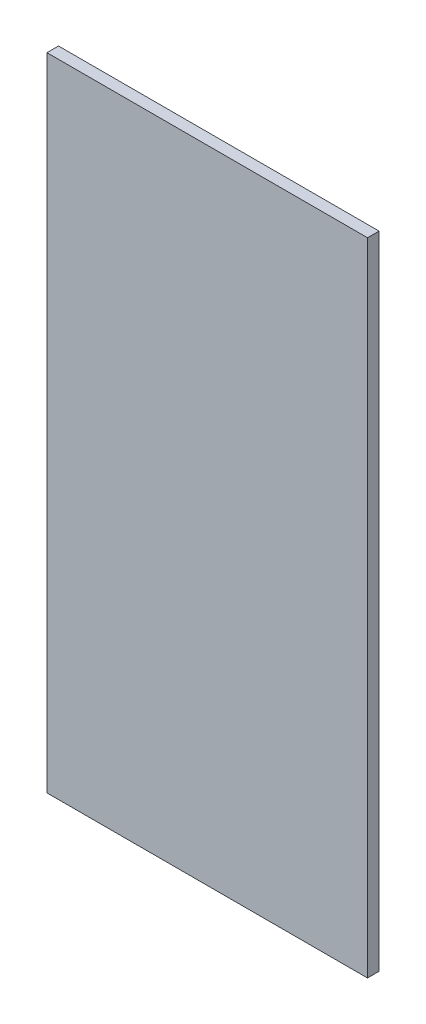
ISO-10303-21;
HEADER;
FILE_DESCRIPTION(('STEP AP214'),'2;1');
FILE_NAME('part.step','',(''),(''),'','','');
FILE_SCHEMA(('AUTOMOTIVE_DESIGN { 1 0 10303 214 1 1 1 1 }'));
ENDSEC;
DATA;
#1=APPLICATION_CONTEXT('core data for automotive mechanical design processes');
#2=APPLICATION_PROTOCOL_DEFINITION('international standard','automotive_design',2000,#1);
#3=PRODUCT_CONTEXT('',#1,'mechanical');
#4=PRODUCT('Part','Part','',(#3));
#5=PRODUCT_RELATED_PRODUCT_CATEGORY('part','',(#4));
#6=PRODUCT_DEFINITION_FORMATION('','',#4);
#7=PRODUCT_DEFINITION_CONTEXT('part definition',#1,'design');
#8=PRODUCT_DEFINITION('design','',#6,#7);
#9=PRODUCT_DEFINITION_SHAPE('','',#8);
#10=(LENGTH_UNIT() NAMED_UNIT(*) SI_UNIT(.MILLI.,.METRE.));
#11=(NAMED_UNIT(*) PLANE_ANGLE_UNIT() SI_UNIT($,.RADIAN.));
#12=(NAMED_UNIT(*) SI_UNIT($,.STERADIAN.) SOLID_ANGLE_UNIT());
#13=UNCERTAINTY_MEASURE_WITH_UNIT(LENGTH_MEASURE(1.E-05),#10,'distance_accuracy_value','');
#14=(GEOMETRIC_REPRESENTATION_CONTEXT(3) GLOBAL_UNCERTAINTY_ASSIGNED_CONTEXT((#13)) GLOBAL_UNIT_ASSIGNED_CONTEXT((#10,
#11,#12)) REPRESENTATION_CONTEXT('',''));
#15=CARTESIAN_POINT('',(0.,0.,0.));
#16=DIRECTION('',(0.,0.,1.));
#17=DIRECTION('',(1.,0.,0.));
#18=AXIS2_PLACEMENT_3D('',#15,#16,#17);
#19=CARTESIAN_POINT('',(0.375,0.5,-0.018));
#20=DIRECTION('',(0.,-1.,0.));
#21=DIRECTION('',(0.,0.,-1.));
#22=AXIS2_PLACEMENT_3D('',#19,#20,#21);
#23=PLANE('',#22);
#24=CARTESIAN_POINT('',(0.375,0.5,-0.018));
#25=CARTESIAN_POINT('',(0.875,0.5,-0.018));
#26=B_SPLINE_CURVE_WITH_KNOTS('',1,(#24,#25),.UNSPECIFIED.,.F.,.F.,(2,2),(-3.,-2.5),.UNSPECIFIED.);
#27=CARTESIAN_POINT('',(0.375,0.5,-0.018));
#28=VERTEX_POINT('',#27);
#29=CARTESIAN_POINT('',(0.875,0.5,-0.018));
#30=VERTEX_POINT('',#29);
#31=EDGE_CURVE('E11',#28,#30,#26,.T.);
#32=ORIENTED_EDGE('',*,*,#31,.T.);
#33=CARTESIAN_POINT('',(0.875,0.5,-0.018));
#34=CARTESIAN_POINT('',(0.875,0.5,0.));
#35=B_SPLINE_CURVE_WITH_KNOTS('',1,(#33,#34),.UNSPECIFIED.,.F.,.F.,(2,2),(0.,0.018),.UNSPECIFIED.);
#36=CARTESIAN_POINT('',(0.875,0.5,0.));
#37=VERTEX_POINT('',#36);
#38=EDGE_CURVE('E26',#30,#37,#35,.T.);
#39=ORIENTED_EDGE('',*,*,#38,.T.);
#40=CARTESIAN_POINT('',(0.375,0.5,0.));
#41=CARTESIAN_POINT('',(0.875,0.5,0.));
#42=B_SPLINE_CURVE_WITH_KNOTS('',1,(#40,#41),.UNSPECIFIED.,.F.,.F.,(2,2),(-3.,-2.5),.UNSPECIFIED.);
#43=CARTESIAN_POINT('',(0.375,0.5,0.));
#44=VERTEX_POINT('',#43);
#45=EDGE_CURVE('E132',#44,#37,#42,.T.);
#46=ORIENTED_EDGE('',*,*,#45,.F.);
#47=CARTESIAN_POINT('',(0.375,0.5,-0.018));
#48=CARTESIAN_POINT('',(0.375,0.5,0.));
#49=B_SPLINE_CURVE_WITH_KNOTS('',1,(#47,#48),.UNSPECIFIED.,.F.,.F.,(2,2),(0.,0.018),.UNSPECIFIED.);
#50=EDGE_CURVE('E79',#28,#44,#49,.T.);
#51=ORIENTED_EDGE('',*,*,#50,.F.);
#52=EDGE_LOOP('',(#32,#39,#46,#51));
#53=FACE_BOUND('',#52,.T.);
#54=ADVANCED_FACE('F17',(#53),#23,.T.);
#55=CARTESIAN_POINT('',(0.875,0.5,-0.018));
#56=DIRECTION('',(1.,0.,0.));
#57=DIRECTION('',(0.,0.,1.));
#58=AXIS2_PLACEMENT_3D('',#55,#56,#57);
#59=PLANE('',#58);
#60=CARTESIAN_POINT('',(0.875,0.5,-0.018));
#61=CARTESIAN_POINT('',(0.875,1.5,-0.018));
#62=B_SPLINE_CURVE_WITH_KNOTS('',1,(#60,#61),.UNSPECIFIED.,.F.,.F.,(2,2),(-2.5,-1.5),.UNSPECIFIED.);
#63=CARTESIAN_POINT('',(0.875,1.5,-0.018));
#64=VERTEX_POINT('',#63);
#65=EDGE_CURVE('E119',#30,#64,#62,.T.);
#66=ORIENTED_EDGE('',*,*,#65,.T.);
#67=CARTESIAN_POINT('',(0.875,1.5,-0.018));
#68=CARTESIAN_POINT('',(0.875,1.5,0.));
#69=B_SPLINE_CURVE_WITH_KNOTS('',1,(#67,#68),.UNSPECIFIED.,.F.,.F.,(2,2),(0.,0.018),.UNSPECIFIED.);
#70=CARTESIAN_POINT('',(0.875,1.5,0.));
#71=VERTEX_POINT('',#70);
#72=EDGE_CURVE('E112',#64,#71,#69,.T.);
#73=ORIENTED_EDGE('',*,*,#72,.T.);
#74=CARTESIAN_POINT('',(0.875,0.5,0.));
#75=CARTESIAN_POINT('',(0.875,1.5,0.));
#76=B_SPLINE_CURVE_WITH_KNOTS('',1,(#74,#75),.UNSPECIFIED.,.F.,.F.,(2,2),(-2.5,-1.5),.UNSPECIFIED.);
#77=EDGE_CURVE('E74',#37,#71,#76,.T.);
#78=ORIENTED_EDGE('',*,*,#77,.F.);
#79=ORIENTED_EDGE('',*,*,#38,.F.);
#80=EDGE_LOOP('',(#66,#73,#78,#79));
#81=FACE_BOUND('',#80,.T.);
#82=ADVANCED_FACE('F147',(#81),#59,.T.);
#83=CARTESIAN_POINT('',(0.875,1.5,-0.018));
#84=DIRECTION('',(0.,1.,0.));
#85=DIRECTION('',(0.,0.,1.));
#86=AXIS2_PLACEMENT_3D('',#83,#84,#85);
#87=PLANE('',#86);
#88=CARTESIAN_POINT('',(0.875,1.5,-0.018));
#89=CARTESIAN_POINT('',(0.375,1.5,-0.018));
#90=B_SPLINE_CURVE_WITH_KNOTS('',1,(#88,#89),.UNSPECIFIED.,.F.,.F.,(2,2),(-1.5,-1.),.UNSPECIFIED.);
#91=CARTESIAN_POINT('',(0.375,1.5,-0.018));
#92=VERTEX_POINT('',#91);
#93=EDGE_CURVE('E62',#64,#92,#90,.T.);
#94=ORIENTED_EDGE('',*,*,#93,.T.);
#95=CARTESIAN_POINT('',(0.375,1.5,-0.018));
#96=CARTESIAN_POINT('',(0.375,1.5,0.));
#97=B_SPLINE_CURVE_WITH_KNOTS('',1,(#95,#96),.UNSPECIFIED.,.F.,.F.,(2,2),(0.,0.018),.UNSPECIFIED.);
#98=CARTESIAN_POINT('',(0.375,1.5,0.));
#99=VERTEX_POINT('',#98);
#100=EDGE_CURVE('E56',#92,#99,#97,.T.);
#101=ORIENTED_EDGE('',*,*,#100,.T.);
#102=CARTESIAN_POINT('',(0.875,1.5,0.));
#103=CARTESIAN_POINT('',(0.375,1.5,0.));
#104=B_SPLINE_CURVE_WITH_KNOTS('',1,(#102,#103),.UNSPECIFIED.,.F.,.F.,(2,2),(-1.5,-1.),.UNSPECIFIED.);
#105=EDGE_CURVE('E60',#71,#99,#104,.T.);
#106=ORIENTED_EDGE('',*,*,#105,.F.);
#107=ORIENTED_EDGE('',*,*,#72,.F.);
#108=EDGE_LOOP('',(#94,#101,#106,#107));
#109=FACE_BOUND('',#108,.T.);
#110=ADVANCED_FACE('F58',(#109),#87,.T.);
#111=CARTESIAN_POINT('',(0.375,1.5,-0.018));
#112=DIRECTION('',(-1.,0.,0.));
#113=DIRECTION('',(0.,0.,-1.));
#114=AXIS2_PLACEMENT_3D('',#111,#112,#113);
#115=PLANE('',#114);
#116=CARTESIAN_POINT('',(0.375,1.5,-0.018));
#117=CARTESIAN_POINT('',(0.375,0.5,-0.018));
#118=B_SPLINE_CURVE_WITH_KNOTS('',1,(#116,#117),.UNSPECIFIED.,.F.,.F.,(2,2),(-1.,0.),.UNSPECIFIED.);
#119=EDGE_CURVE('E75',#92,#28,#118,.T.);
#120=ORIENTED_EDGE('',*,*,#119,.T.);
#121=ORIENTED_EDGE('',*,*,#50,.T.);
#122=CARTESIAN_POINT('',(0.375,1.5,0.));
#123=CARTESIAN_POINT('',(0.375,0.5,0.));
#124=B_SPLINE_CURVE_WITH_KNOTS('',1,(#122,#123),.UNSPECIFIED.,.F.,.F.,(2,2),(-1.,0.),.UNSPECIFIED.);
#125=EDGE_CURVE('E72',#99,#44,#124,.T.);
#126=ORIENTED_EDGE('',*,*,#125,.F.);
#127=ORIENTED_EDGE('',*,*,#100,.F.);
#128=EDGE_LOOP('',(#120,#121,#126,#127));
#129=FACE_BOUND('',#128,.T.);
#130=ADVANCED_FACE('F78',(#129),#115,.T.);
#131=CARTESIAN_POINT('',(0.875,1.5,-0.018));
#132=DIRECTION('',(0.,0.,-1.));
#133=DIRECTION('',(-1.,0.,0.));
#134=AXIS2_PLACEMENT_3D('',#131,#132,#133);
#135=PLANE('',#134);
#136=ORIENTED_EDGE('',*,*,#119,.F.);
#137=ORIENTED_EDGE('',*,*,#93,.F.);
#138=ORIENTED_EDGE('',*,*,#65,.F.);
#139=ORIENTED_EDGE('',*,*,#31,.F.);
#140=EDGE_LOOP('',(#136,#137,#138,#139));
#141=FACE_BOUND('',#140,.T.);
#142=ADVANCED_FACE('F148',(#141),#135,.T.);
#143=CARTESIAN_POINT('',(0.875,1.5,0.));
#144=DIRECTION('',(0.,0.,1.));
#145=DIRECTION('',(1.,0.,0.));
#146=AXIS2_PLACEMENT_3D('',#143,#144,#145);
#147=PLANE('',#146);
#148=ORIENTED_EDGE('',*,*,#45,.T.);
#149=ORIENTED_EDGE('',*,*,#77,.T.);
#150=ORIENTED_EDGE('',*,*,#105,.T.);
#151=ORIENTED_EDGE('',*,*,#125,.T.);
#152=EDGE_LOOP('',(#148,#149,#150,#151));
#153=FACE_BOUND('',#152,.T.);
#154=ADVANCED_FACE('F71',(#153),#147,.T.);
#155=CLOSED_SHELL('',(#54,#82,#110,#130,#142,#154));
#156=MANIFOLD_SOLID_BREP('B1',#155);
#157=ADVANCED_BREP_SHAPE_REPRESENTATION('',(#18,#156),#14);
#158=SHAPE_DEFINITION_REPRESENTATION(#9,#157);
ENDSEC;
END-ISO-10303-21;
